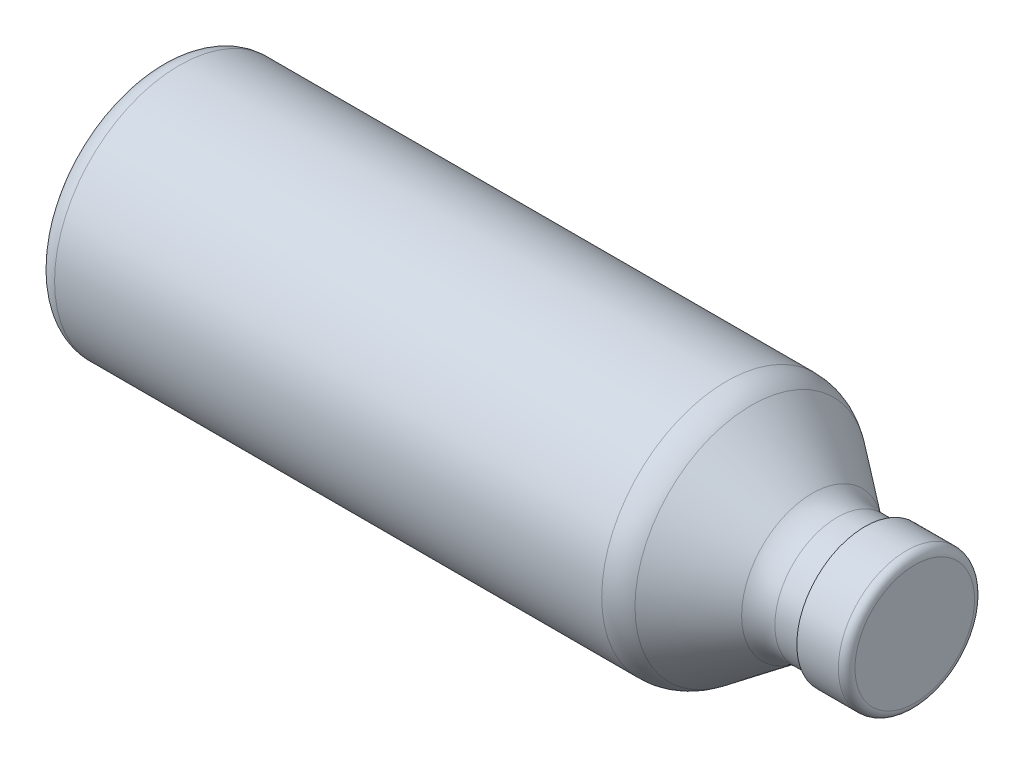
ISO-10303-21;
HEADER;
FILE_DESCRIPTION(('STEP AP214'),'2;1');
FILE_NAME('part.step','',(''),(''),'','','');
FILE_SCHEMA(('AUTOMOTIVE_DESIGN { 1 0 10303 214 1 1 1 1 }'));
ENDSEC;
DATA;
#1=APPLICATION_CONTEXT('core data for automotive mechanical design processes');
#2=APPLICATION_PROTOCOL_DEFINITION('international standard','automotive_design',2000,#1);
#3=PRODUCT_CONTEXT('',#1,'mechanical');
#4=PRODUCT('Part','Part','',(#3));
#5=PRODUCT_RELATED_PRODUCT_CATEGORY('part','',(#4));
#6=PRODUCT_DEFINITION_FORMATION('','',#4);
#7=PRODUCT_DEFINITION_CONTEXT('part definition',#1,'design');
#8=PRODUCT_DEFINITION('design','',#6,#7);
#9=PRODUCT_DEFINITION_SHAPE('','',#8);
#10=(LENGTH_UNIT() NAMED_UNIT(*) SI_UNIT(.MILLI.,.METRE.));
#11=(NAMED_UNIT(*) PLANE_ANGLE_UNIT() SI_UNIT($,.RADIAN.));
#12=(NAMED_UNIT(*) SI_UNIT($,.STERADIAN.) SOLID_ANGLE_UNIT());
#13=UNCERTAINTY_MEASURE_WITH_UNIT(LENGTH_MEASURE(1.E-05),#10,'distance_accuracy_value','');
#14=(GEOMETRIC_REPRESENTATION_CONTEXT(3) GLOBAL_UNCERTAINTY_ASSIGNED_CONTEXT((#13)) GLOBAL_UNIT_ASSIGNED_CONTEXT((#10,
#11,#12)) REPRESENTATION_CONTEXT('',''));
#15=CARTESIAN_POINT('',(0.,0.,0.));
#16=DIRECTION('',(0.,0.,1.));
#17=DIRECTION('',(1.,0.,0.));
#18=AXIS2_PLACEMENT_3D('',#15,#16,#17);
#19=CARTESIAN_POINT('',(170.,0.,0.));
#20=DIRECTION('',(1.,0.,0.));
#21=DIRECTION('',(0.,0.,-1.));
#22=AXIS2_PLACEMENT_3D('',#19,#20,#21);
#23=CYLINDRICAL_SURFACE('',#22,16.3916133385911);
#24=CARTESIAN_POINT('',(180.,0.,0.));
#25=DIRECTION('',(1.,0.,0.));
#26=DIRECTION('',(0.,0.,-1.));
#27=AXIS2_PLACEMENT_3D('',#24,#25,#26);
#28=CIRCLE('',#27,16.3916133385911);
#29=CARTESIAN_POINT('',(180.,0.,-16.3916133385911));
#30=VERTEX_POINT('',#29);
#31=EDGE_CURVE('E10',#30,#30,#28,.F.);
#32=ORIENTED_EDGE('',*,*,#31,.T.);
#33=EDGE_LOOP('',(#32));
#34=FACE_BOUND('',#33,.T.);
#35=CARTESIAN_POINT('',(170.,0.,0.));
#36=DIRECTION('',(1.,0.,0.));
#37=DIRECTION('',(0.,0.,-1.));
#38=AXIS2_PLACEMENT_3D('',#35,#36,#37);
#39=CIRCLE('',#38,16.3916133385911);
#40=CARTESIAN_POINT('',(170.,0.,-16.3916133385911));
#41=VERTEX_POINT('',#40);
#42=EDGE_CURVE('E75',#41,#41,#39,.T.);
#43=ORIENTED_EDGE('',*,*,#42,.T.);
#44=EDGE_LOOP('',(#43));
#45=FACE_BOUND('',#44,.T.);
#46=ADVANCED_FACE('F34',(#34,#45),#23,.T.);
#47=CARTESIAN_POINT('',(170.,0.,0.));
#48=DIRECTION('',(1.,0.,0.));
#49=DIRECTION('',(0.,0.,-1.));
#50=AXIS2_PLACEMENT_3D('',#47,#48,#49);
#51=PLANE('',#50);
#52=CARTESIAN_POINT('',(170.,0.,0.));
#53=DIRECTION('',(1.,0.,0.));
#54=DIRECTION('',(0.,0.,-1.));
#55=AXIS2_PLACEMENT_3D('',#52,#53,#54);
#56=CIRCLE('',#55,15.);
#57=CARTESIAN_POINT('',(170.,0.,-15.));
#58=VERTEX_POINT('',#57);
#59=EDGE_CURVE('E46',#58,#58,#56,.T.);
#60=ORIENTED_EDGE('',*,*,#59,.T.);
#61=EDGE_LOOP('',(#60));
#62=FACE_BOUND('',#61,.T.);
#63=ORIENTED_EDGE('',*,*,#42,.F.);
#64=EDGE_LOOP('',(#63));
#65=FACE_BOUND('',#64,.T.);
#66=ADVANCED_FACE('F96',(#62,#65),#51,.F.);
#67=CARTESIAN_POINT('',(0.,30.,0.));
#68=DIRECTION('',(1.,0.,0.));
#69=DIRECTION('',(0.,0.,-1.));
#70=AXIS2_PLACEMENT_3D('',#67,#68,#69);
#71=PLANE('',#70);
#72=CARTESIAN_POINT('',(0.,0.,0.));
#73=DIRECTION('',(1.,0.,0.));
#74=DIRECTION('',(0.,0.,-1.));
#75=AXIS2_PLACEMENT_3D('',#72,#73,#74);
#76=CIRCLE('',#75,25.);
#77=CARTESIAN_POINT('',(0.,0.,-25.));
#78=VERTEX_POINT('',#77);
#79=EDGE_CURVE('E55',#78,#78,#76,.F.);
#80=ORIENTED_EDGE('',*,*,#79,.T.);
#81=EDGE_LOOP('',(#80));
#82=FACE_BOUND('',#81,.T.);
#83=ADVANCED_FACE('F98',(#82),#71,.F.);
#84=CARTESIAN_POINT('',(5.,0.,0.));
#85=DIRECTION('',(1.,0.,0.));
#86=DIRECTION('',(0.,0.,-1.));
#87=AXIS2_PLACEMENT_3D('',#84,#85,#86);
#88=TOROIDAL_SURFACE('',#87,25.,5.);
#89=CARTESIAN_POINT('',(5.,0.,0.));
#90=DIRECTION('',(1.,0.,0.));
#91=DIRECTION('',(0.,0.,-1.));
#92=AXIS2_PLACEMENT_3D('',#89,#90,#91);
#93=CIRCLE('',#92,30.);
#94=CARTESIAN_POINT('',(5.,0.,-30.));
#95=VERTEX_POINT('',#94);
#96=EDGE_CURVE('E50',#95,#95,#93,.T.);
#97=ORIENTED_EDGE('',*,*,#96,.F.);
#98=EDGE_LOOP('',(#97));
#99=FACE_BOUND('',#98,.T.);
#100=ORIENTED_EDGE('',*,*,#79,.F.);
#101=EDGE_LOOP('',(#100));
#102=FACE_BOUND('',#101,.T.);
#103=ADVANCED_FACE('F105',(#99,#102),#88,.T.);
#104=CARTESIAN_POINT('',(0.,0.,0.));
#105=DIRECTION('',(-1.,0.,0.));
#106=DIRECTION('',(0.,0.,1.));
#107=AXIS2_PLACEMENT_3D('',#104,#105,#106);
#108=CYLINDRICAL_SURFACE('',#107,30.);
#109=ORIENTED_EDGE('',*,*,#96,.T.);
#110=EDGE_LOOP('',(#109));
#111=FACE_BOUND('',#110,.T.);
#112=CARTESIAN_POINT('',(136.666666666667,0.,0.));
#113=DIRECTION('',(-1.,0.,0.));
#114=DIRECTION('',(0.,0.,1.));
#115=AXIS2_PLACEMENT_3D('',#112,#113,#114);
#116=CIRCLE('',#115,30.);
#117=CARTESIAN_POINT('',(136.666666666667,0.,30.));
#118=VERTEX_POINT('',#117);
#119=EDGE_CURVE('E58',#118,#118,#116,.T.);
#120=ORIENTED_EDGE('',*,*,#119,.T.);
#121=EDGE_LOOP('',(#120));
#122=FACE_BOUND('',#121,.T.);
#123=ADVANCED_FACE('F158',(#111,#122),#108,.T.);
#124=CARTESIAN_POINT('',(136.666666666667,0.,0.));
#125=DIRECTION('',(-1.,0.,0.));
#126=DIRECTION('',(0.,0.,1.));
#127=AXIS2_PLACEMENT_3D('',#124,#125,#126);
#128=TOROIDAL_SURFACE('',#127,20.,10.);
#129=ORIENTED_EDGE('',*,*,#119,.F.);
#130=EDGE_LOOP('',(#129));
#131=FACE_BOUND('',#130,.T.);
#132=CARTESIAN_POINT('',(142.666666666667,0.,0.));
#133=DIRECTION('',(-1.,0.,0.));
#134=DIRECTION('',(0.,0.,1.));
#135=AXIS2_PLACEMENT_3D('',#132,#133,#134);
#136=CIRCLE('',#135,28.);
#137=CARTESIAN_POINT('',(142.666666666667,0.,28.));
#138=VERTEX_POINT('',#137);
#139=EDGE_CURVE('E61',#138,#138,#136,.T.);
#140=ORIENTED_EDGE('',*,*,#139,.T.);
#141=EDGE_LOOP('',(#140));
#142=FACE_BOUND('',#141,.T.);
#143=ADVANCED_FACE('F154',(#131,#142),#128,.T.);
#144=CARTESIAN_POINT('',(157.333333333333,0.,0.));
#145=DIRECTION('',(-1.,0.,0.));
#146=DIRECTION('',(0.,0.,1.));
#147=AXIS2_PLACEMENT_3D('',#144,#145,#146);
#148=CONICAL_SURFACE('',#147,17.,0.643501108793286);
#149=ORIENTED_EDGE('',*,*,#139,.F.);
#150=EDGE_LOOP('',(#149));
#151=FACE_BOUND('',#150,.T.);
#152=CARTESIAN_POINT('',(157.333333333333,0.,0.));
#153=DIRECTION('',(-1.,0.,0.));
#154=DIRECTION('',(0.,0.,1.));
#155=AXIS2_PLACEMENT_3D('',#152,#153,#154);
#156=CIRCLE('',#155,17.);
#157=CARTESIAN_POINT('',(157.333333333333,0.,17.));
#158=VERTEX_POINT('',#157);
#159=EDGE_CURVE('E64',#158,#158,#156,.T.);
#160=ORIENTED_EDGE('',*,*,#159,.T.);
#161=EDGE_LOOP('',(#160));
#162=FACE_BOUND('',#161,.T.);
#163=ADVANCED_FACE('F150',(#151,#162),#148,.T.);
#164=CARTESIAN_POINT('',(163.333333333333,0.,0.));
#165=DIRECTION('',(-1.,0.,0.));
#166=DIRECTION('',(0.,0.,1.));
#167=AXIS2_PLACEMENT_3D('',#164,#165,#166);
#168=TOROIDAL_SURFACE('',#167,25.,10.);
#169=ORIENTED_EDGE('',*,*,#159,.F.);
#170=EDGE_LOOP('',(#169));
#171=FACE_BOUND('',#170,.T.);
#172=CARTESIAN_POINT('',(163.333333333333,0.,0.));
#173=DIRECTION('',(-1.,0.,0.));
#174=DIRECTION('',(0.,0.,1.));
#175=AXIS2_PLACEMENT_3D('',#172,#173,#174);
#176=CIRCLE('',#175,15.);
#177=CARTESIAN_POINT('',(163.333333333333,0.,15.));
#178=VERTEX_POINT('',#177);
#179=EDGE_CURVE('E67',#178,#178,#176,.T.);
#180=ORIENTED_EDGE('',*,*,#179,.T.);
#181=EDGE_LOOP('',(#180));
#182=FACE_BOUND('',#181,.T.);
#183=ADVANCED_FACE('F146',(#171,#182),#168,.F.);
#184=CARTESIAN_POINT('',(0.,0.,0.));
#185=DIRECTION('',(-1.,0.,0.));
#186=DIRECTION('',(0.,0.,1.));
#187=AXIS2_PLACEMENT_3D('',#184,#185,#186);
#188=CYLINDRICAL_SURFACE('',#187,15.);
#189=ORIENTED_EDGE('',*,*,#179,.F.);
#190=EDGE_LOOP('',(#189));
#191=FACE_BOUND('',#190,.T.);
#192=ORIENTED_EDGE('',*,*,#59,.F.);
#193=EDGE_LOOP('',(#192));
#194=FACE_BOUND('',#193,.T.);
#195=ADVANCED_FACE('F142',(#191,#194),#188,.T.);
#196=CARTESIAN_POINT('',(182.,0.,0.));
#197=DIRECTION('',(1.,0.,0.));
#198=DIRECTION('',(0.,0.,-1.));
#199=AXIS2_PLACEMENT_3D('',#196,#197,#198);
#200=PLANE('',#199);
#201=CARTESIAN_POINT('',(182.,0.,0.));
#202=DIRECTION('',(1.,0.,0.));
#203=DIRECTION('',(0.,0.,-1.));
#204=AXIS2_PLACEMENT_3D('',#201,#202,#203);
#205=CIRCLE('',#204,14.3916133385911);
#206=CARTESIAN_POINT('',(182.,0.,-14.3916133385911));
#207=VERTEX_POINT('',#206);
#208=EDGE_CURVE('E42',#207,#207,#205,.T.);
#209=ORIENTED_EDGE('',*,*,#208,.T.);
#210=EDGE_LOOP('',(#209));
#211=FACE_BOUND('',#210,.T.);
#212=ADVANCED_FACE('F145',(#211),#200,.T.);
#213=CARTESIAN_POINT('',(180.,0.,0.));
#214=DIRECTION('',(1.,0.,0.));
#215=DIRECTION('',(0.,0.,-1.));
#216=AXIS2_PLACEMENT_3D('',#213,#214,#215);
#217=TOROIDAL_SURFACE('',#216,14.3916133385911,2.);
#218=ORIENTED_EDGE('',*,*,#31,.F.);
#219=EDGE_LOOP('',(#218));
#220=FACE_BOUND('',#219,.T.);
#221=ORIENTED_EDGE('',*,*,#208,.F.);
#222=EDGE_LOOP('',(#221));
#223=FACE_BOUND('',#222,.T.);
#224=ADVANCED_FACE('F36',(#220,#223),#217,.T.);
#225=CLOSED_SHELL('',(#46,#66,#83,#103,#123,#143,#163,#183,#195,#212,#224));
#226=CARTESIAN_POINT('',(180.,0.,0.));
#227=DIRECTION('',(1.,0.,0.));
#228=DIRECTION('',(0.,0.,-1.));
#229=AXIS2_PLACEMENT_3D('',#226,#227,#228);
#230=PLANE('',#229);
#231=CARTESIAN_POINT('',(180.,0.,0.));
#232=DIRECTION('',(-1.,0.,0.));
#233=DIRECTION('',(0.,0.,1.));
#234=AXIS2_PLACEMENT_3D('',#231,#232,#233);
#235=CIRCLE('',#234,14.);
#236=CARTESIAN_POINT('',(180.,0.,14.));
#237=VERTEX_POINT('',#236);
#238=EDGE_CURVE('E71',#237,#237,#235,.T.);
#239=ORIENTED_EDGE('',*,*,#238,.T.);
#240=EDGE_LOOP('',(#239));
#241=FACE_BOUND('',#240,.T.);
#242=ADVANCED_FACE('F110',(#241),#230,.F.);
#243=CARTESIAN_POINT('',(1.,30.,0.));
#244=DIRECTION('',(1.,0.,0.));
#245=DIRECTION('',(0.,0.,-1.));
#246=AXIS2_PLACEMENT_3D('',#243,#244,#245);
#247=PLANE('',#246);
#248=CARTESIAN_POINT('',(1.,0.,0.));
#249=DIRECTION('',(1.,0.,0.));
#250=DIRECTION('',(0.,0.,-1.));
#251=AXIS2_PLACEMENT_3D('',#248,#249,#250);
#252=CIRCLE('',#251,25.);
#253=CARTESIAN_POINT('',(1.,0.,-25.));
#254=VERTEX_POINT('',#253);
#255=EDGE_CURVE('E87',#254,#254,#252,.F.);
#256=ORIENTED_EDGE('',*,*,#255,.F.);
#257=EDGE_LOOP('',(#256));
#258=FACE_BOUND('',#257,.T.);
#259=ADVANCED_FACE('F113',(#258),#247,.T.);
#260=CARTESIAN_POINT('',(5.,0.,0.));
#261=DIRECTION('',(1.,0.,0.));
#262=DIRECTION('',(0.,0.,-1.));
#263=AXIS2_PLACEMENT_3D('',#260,#261,#262);
#264=TOROIDAL_SURFACE('',#263,25.,4.);
#265=CARTESIAN_POINT('',(5.,0.,0.));
#266=DIRECTION('',(-1.,0.,0.));
#267=DIRECTION('',(0.,0.,1.));
#268=AXIS2_PLACEMENT_3D('',#265,#266,#267);
#269=CIRCLE('',#268,29.);
#270=CARTESIAN_POINT('',(5.,0.,29.));
#271=VERTEX_POINT('',#270);
#272=EDGE_CURVE('E70',#271,#271,#269,.F.);
#273=ORIENTED_EDGE('',*,*,#272,.T.);
#274=EDGE_LOOP('',(#273));
#275=FACE_BOUND('',#274,.T.);
#276=ORIENTED_EDGE('',*,*,#255,.T.);
#277=EDGE_LOOP('',(#276));
#278=FACE_BOUND('',#277,.T.);
#279=ADVANCED_FACE('F116',(#275,#278),#264,.F.);
#280=CARTESIAN_POINT('',(0.,0.,0.));
#281=DIRECTION('',(-1.,0.,0.));
#282=DIRECTION('',(0.,0.,1.));
#283=AXIS2_PLACEMENT_3D('',#280,#281,#282);
#284=CYLINDRICAL_SURFACE('',#283,29.);
#285=ORIENTED_EDGE('',*,*,#272,.F.);
#286=EDGE_LOOP('',(#285));
#287=FACE_BOUND('',#286,.T.);
#288=CARTESIAN_POINT('',(136.666666666667,0.,0.));
#289=DIRECTION('',(-1.,0.,0.));
#290=DIRECTION('',(0.,0.,1.));
#291=AXIS2_PLACEMENT_3D('',#288,#289,#290);
#292=CIRCLE('',#291,29.);
#293=CARTESIAN_POINT('',(136.666666666667,0.,29.));
#294=VERTEX_POINT('',#293);
#295=EDGE_CURVE('E84',#294,#294,#292,.T.);
#296=ORIENTED_EDGE('',*,*,#295,.F.);
#297=EDGE_LOOP('',(#296));
#298=FACE_BOUND('',#297,.T.);
#299=ADVANCED_FACE('F119',(#287,#298),#284,.F.);
#300=CARTESIAN_POINT('',(136.666666666667,0.,0.));
#301=DIRECTION('',(-1.,0.,0.));
#302=DIRECTION('',(0.,0.,1.));
#303=AXIS2_PLACEMENT_3D('',#300,#301,#302);
#304=TOROIDAL_SURFACE('',#303,20.,9.00000000000001);
#305=ORIENTED_EDGE('',*,*,#295,.T.);
#306=EDGE_LOOP('',(#305));
#307=FACE_BOUND('',#306,.T.);
#308=CARTESIAN_POINT('',(142.066666666667,0.,0.));
#309=DIRECTION('',(-1.,0.,0.));
#310=DIRECTION('',(0.,0.,1.));
#311=AXIS2_PLACEMENT_3D('',#308,#309,#310);
#312=CIRCLE('',#311,27.2);
#313=CARTESIAN_POINT('',(142.066666666667,0.,27.2));
#314=VERTEX_POINT('',#313);
#315=EDGE_CURVE('E81',#314,#314,#312,.T.);
#316=ORIENTED_EDGE('',*,*,#315,.F.);
#317=EDGE_LOOP('',(#316));
#318=FACE_BOUND('',#317,.T.);
#319=ADVANCED_FACE('F122',(#307,#318),#304,.F.);
#320=CARTESIAN_POINT('',(156.733333333333,0.,0.));
#321=DIRECTION('',(-1.,0.,0.));
#322=DIRECTION('',(0.,0.,1.));
#323=AXIS2_PLACEMENT_3D('',#320,#321,#322);
#324=CONICAL_SURFACE('',#323,16.2,0.643501108793286);
#325=ORIENTED_EDGE('',*,*,#315,.T.);
#326=EDGE_LOOP('',(#325));
#327=FACE_BOUND('',#326,.T.);
#328=CARTESIAN_POINT('',(156.733333333333,0.,0.));
#329=DIRECTION('',(-1.,0.,0.));
#330=DIRECTION('',(0.,0.,1.));
#331=AXIS2_PLACEMENT_3D('',#328,#329,#330);
#332=CIRCLE('',#331,16.2);
#333=CARTESIAN_POINT('',(156.733333333333,0.,16.2));
#334=VERTEX_POINT('',#333);
#335=EDGE_CURVE('E78',#334,#334,#332,.T.);
#336=ORIENTED_EDGE('',*,*,#335,.F.);
#337=EDGE_LOOP('',(#336));
#338=FACE_BOUND('',#337,.T.);
#339=ADVANCED_FACE('F126',(#327,#338),#324,.F.);
#340=CARTESIAN_POINT('',(163.333333333333,0.,0.));
#341=DIRECTION('',(-1.,0.,0.));
#342=DIRECTION('',(0.,0.,1.));
#343=AXIS2_PLACEMENT_3D('',#340,#341,#342);
#344=TOROIDAL_SURFACE('',#343,25.,11.);
#345=ORIENTED_EDGE('',*,*,#335,.T.);
#346=EDGE_LOOP('',(#345));
#347=FACE_BOUND('',#346,.T.);
#348=CARTESIAN_POINT('',(163.333333333333,0.,0.));
#349=DIRECTION('',(-1.,0.,0.));
#350=DIRECTION('',(0.,0.,1.));
#351=AXIS2_PLACEMENT_3D('',#348,#349,#350);
#352=CIRCLE('',#351,14.);
#353=CARTESIAN_POINT('',(163.333333333333,0.,14.));
#354=VERTEX_POINT('',#353);
#355=EDGE_CURVE('E74',#354,#354,#352,.T.);
#356=ORIENTED_EDGE('',*,*,#355,.F.);
#357=EDGE_LOOP('',(#356));
#358=FACE_BOUND('',#357,.T.);
#359=ADVANCED_FACE('F130',(#347,#358),#344,.T.);
#360=CARTESIAN_POINT('',(0.,0.,0.));
#361=DIRECTION('',(-1.,0.,0.));
#362=DIRECTION('',(0.,0.,1.));
#363=AXIS2_PLACEMENT_3D('',#360,#361,#362);
#364=CYLINDRICAL_SURFACE('',#363,14.);
#365=ORIENTED_EDGE('',*,*,#355,.T.);
#366=EDGE_LOOP('',(#365));
#367=FACE_BOUND('',#366,.T.);
#368=ORIENTED_EDGE('',*,*,#238,.F.);
#369=EDGE_LOOP('',(#368));
#370=FACE_BOUND('',#369,.T.);
#371=ADVANCED_FACE('F134',(#367,#370),#364,.F.);
#372=CLOSED_SHELL('',(#242,#259,#279,#299,#319,#339,#359,#371));
#373=ORIENTED_CLOSED_SHELL('',*,#372,.T.);
#374=BREP_WITH_VOIDS('B2',#225,(#373));
#375=ADVANCED_BREP_SHAPE_REPRESENTATION('',(#18,#374),#14);
#376=SHAPE_DEFINITION_REPRESENTATION(#9,#375);
ENDSEC;
END-ISO-10303-21;
